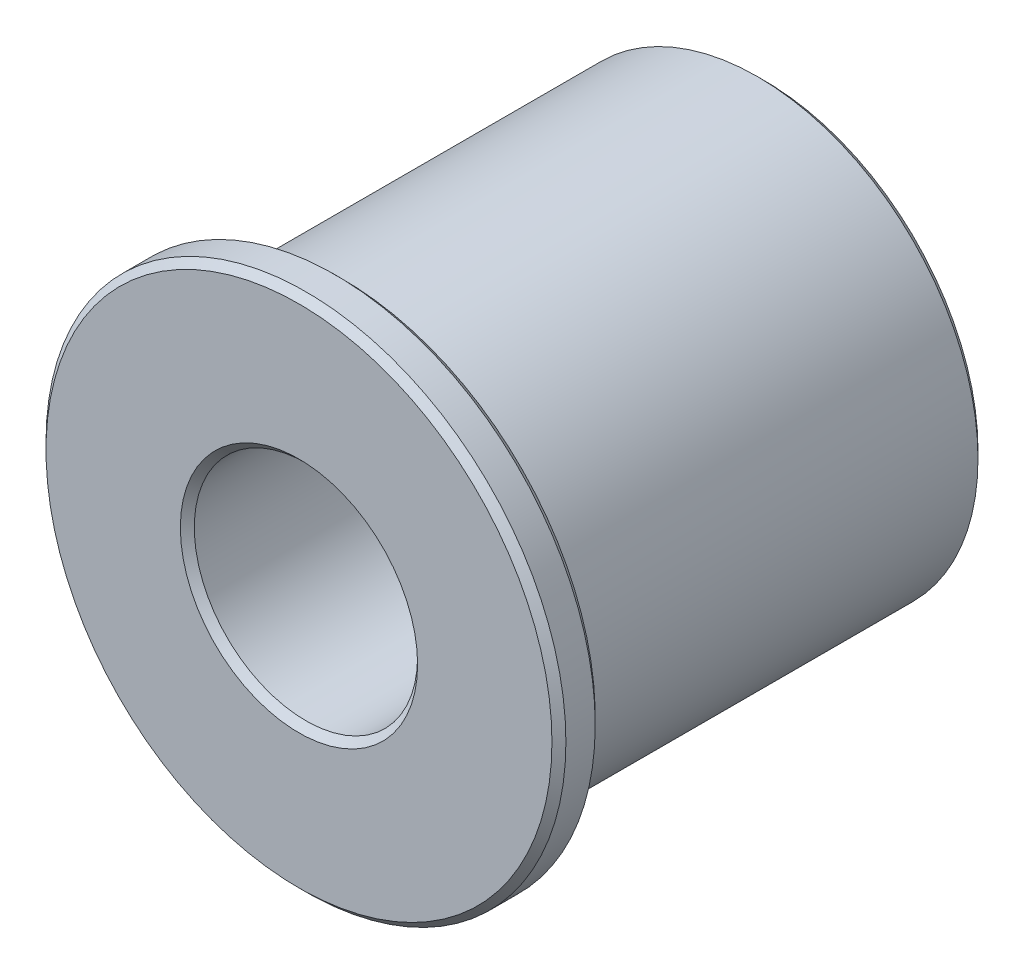
ISO-10303-21;
HEADER;
FILE_DESCRIPTION(('STEP AP214'),'2;1');
FILE_NAME('part.step','',(''),(''),'','','');
FILE_SCHEMA(('AUTOMOTIVE_DESIGN { 1 0 10303 214 1 1 1 1 }'));
ENDSEC;
DATA;
#1=APPLICATION_CONTEXT('core data for automotive mechanical design processes');
#2=APPLICATION_PROTOCOL_DEFINITION('international standard','automotive_design',2000,#1);
#3=PRODUCT_CONTEXT('',#1,'mechanical');
#4=PRODUCT('Part','Part','',(#3));
#5=PRODUCT_RELATED_PRODUCT_CATEGORY('part','',(#4));
#6=PRODUCT_DEFINITION_FORMATION('','',#4);
#7=PRODUCT_DEFINITION_CONTEXT('part definition',#1,'design');
#8=PRODUCT_DEFINITION('design','',#6,#7);
#9=PRODUCT_DEFINITION_SHAPE('','',#8);
#10=(LENGTH_UNIT() NAMED_UNIT(*) SI_UNIT(.MILLI.,.METRE.));
#11=(NAMED_UNIT(*) PLANE_ANGLE_UNIT() SI_UNIT($,.RADIAN.));
#12=(NAMED_UNIT(*) SI_UNIT($,.STERADIAN.) SOLID_ANGLE_UNIT());
#13=UNCERTAINTY_MEASURE_WITH_UNIT(LENGTH_MEASURE(1.E-05),#10,'distance_accuracy_value','');
#14=(GEOMETRIC_REPRESENTATION_CONTEXT(3) GLOBAL_UNCERTAINTY_ASSIGNED_CONTEXT((#13)) GLOBAL_UNIT_ASSIGNED_CONTEXT((#10,
#11,#12)) REPRESENTATION_CONTEXT('',''));
#15=CARTESIAN_POINT('',(0.,0.,0.));
#16=DIRECTION('',(0.,0.,1.));
#17=DIRECTION('',(1.,0.,0.));
#18=AXIS2_PLACEMENT_3D('',#15,#16,#17);
#19=CARTESIAN_POINT('',(0.,0.,0.));
#20=DIRECTION('',(0.,0.,1.));
#21=DIRECTION('',(1.,0.,0.));
#22=AXIS2_PLACEMENT_3D('',#19,#20,#21);
#23=CYLINDRICAL_SURFACE('',#22,2.286);
#24=CARTESIAN_POINT('',(0.,0.,10.346));
#25=DIRECTION('',(0.,0.,1.));
#26=DIRECTION('',(1.,0.,0.));
#27=AXIS2_PLACEMENT_3D('',#24,#25,#26);
#28=CIRCLE('',#27,2.286);
#29=CARTESIAN_POINT('',(2.286,0.,10.346));
#30=VERTEX_POINT('',#29);
#31=EDGE_CURVE('E71',#30,#30,#28,.T.);
#32=ORIENTED_EDGE('',*,*,#31,.T.);
#33=EDGE_LOOP('',(#32));
#34=FACE_BOUND('',#33,.T.);
#35=CARTESIAN_POINT('',(0.,0.,0.254));
#36=DIRECTION('',(0.,0.,-1.));
#37=DIRECTION('',(-1.,0.,0.));
#38=AXIS2_PLACEMENT_3D('',#35,#36,#37);
#39=CIRCLE('',#38,2.286);
#40=CARTESIAN_POINT('',(-2.286,0.,0.254));
#41=VERTEX_POINT('',#40);
#42=EDGE_CURVE('E74',#41,#41,#39,.T.);
#43=ORIENTED_EDGE('',*,*,#42,.T.);
#44=EDGE_LOOP('',(#43));
#45=FACE_BOUND('',#44,.T.);
#46=ADVANCED_FACE('F33',(#34,#45),#23,.F.);
#47=CARTESIAN_POINT('',(2.286,0.,10.6));
#48=DIRECTION('',(0.,0.,1.));
#49=DIRECTION('',(1.,0.,0.));
#50=AXIS2_PLACEMENT_3D('',#47,#48,#49);
#51=PLANE('',#50);
#52=CARTESIAN_POINT('',(0.,0.,10.6));
#53=DIRECTION('',(0.,0.,1.));
#54=DIRECTION('',(1.,0.,0.));
#55=AXIS2_PLACEMENT_3D('',#52,#53,#54);
#56=CIRCLE('',#55,2.54);
#57=CARTESIAN_POINT('',(2.54000000000001,0.,10.6));
#58=VERTEX_POINT('',#57);
#59=EDGE_CURVE('E68',#58,#58,#56,.F.);
#60=ORIENTED_EDGE('',*,*,#59,.T.);
#61=EDGE_LOOP('',(#60));
#62=FACE_BOUND('',#61,.T.);
#63=CARTESIAN_POINT('',(0.,0.,10.6));
#64=DIRECTION('',(0.,0.,1.));
#65=DIRECTION('',(1.,0.,0.));
#66=AXIS2_PLACEMENT_3D('',#63,#64,#65);
#67=CIRCLE('',#66,4.064);
#68=CARTESIAN_POINT('',(4.064,0.,10.6));
#69=VERTEX_POINT('',#68);
#70=EDGE_CURVE('E77',#69,#69,#67,.T.);
#71=ORIENTED_EDGE('',*,*,#70,.T.);
#72=EDGE_LOOP('',(#71));
#73=FACE_BOUND('',#72,.T.);
#74=ADVANCED_FACE('F101',(#62,#73),#51,.T.);
#75=CARTESIAN_POINT('',(0.,0.,0.));
#76=DIRECTION('',(0.,0.,1.));
#77=DIRECTION('',(1.,0.,0.));
#78=AXIS2_PLACEMENT_3D('',#75,#76,#77);
#79=CYLINDRICAL_SURFACE('',#78,4.064);
#80=CARTESIAN_POINT('',(0.,0.,16.6878));
#81=DIRECTION('',(0.,0.,1.));
#82=DIRECTION('',(1.,0.,0.));
#83=AXIS2_PLACEMENT_3D('',#80,#81,#82);
#84=CIRCLE('',#83,4.064);
#85=CARTESIAN_POINT('',(4.064,0.,16.6878));
#86=VERTEX_POINT('',#85);
#87=EDGE_CURVE('E56',#86,#86,#84,.T.);
#88=ORIENTED_EDGE('',*,*,#87,.T.);
#89=EDGE_LOOP('',(#88));
#90=FACE_BOUND('',#89,.T.);
#91=ORIENTED_EDGE('',*,*,#70,.F.);
#92=EDGE_LOOP('',(#91));
#93=FACE_BOUND('',#92,.T.);
#94=ADVANCED_FACE('F107',(#90,#93),#79,.F.);
#95=CARTESIAN_POINT('',(4.064,0.,16.9418));
#96=DIRECTION('',(0.,0.,1.));
#97=DIRECTION('',(1.,0.,0.));
#98=AXIS2_PLACEMENT_3D('',#95,#96,#97);
#99=PLANE('',#98);
#100=CARTESIAN_POINT('',(0.,0.,16.9418));
#101=DIRECTION('',(0.,0.,1.));
#102=DIRECTION('',(1.,0.,0.));
#103=AXIS2_PLACEMENT_3D('',#100,#101,#102);
#104=CIRCLE('',#103,4.31800000000001);
#105=CARTESIAN_POINT('',(4.31800000000001,0.,16.9418));
#106=VERTEX_POINT('',#105);
#107=EDGE_CURVE('E48',#106,#106,#104,.F.);
#108=ORIENTED_EDGE('',*,*,#107,.T.);
#109=EDGE_LOOP('',(#108));
#110=FACE_BOUND('',#109,.T.);
#111=CARTESIAN_POINT('',(0.,0.,16.9418));
#112=DIRECTION('',(0.,0.,1.));
#113=DIRECTION('',(1.,0.,0.));
#114=AXIS2_PLACEMENT_3D('',#111,#112,#113);
#115=CIRCLE('',#114,9.2075);
#116=CARTESIAN_POINT('',(9.2075,0.,16.9418));
#117=VERTEX_POINT('',#116);
#118=EDGE_CURVE('E53',#117,#117,#115,.T.);
#119=ORIENTED_EDGE('',*,*,#118,.T.);
#120=EDGE_LOOP('',(#119));
#121=FACE_BOUND('',#120,.T.);
#122=ADVANCED_FACE('F141',(#110,#121),#99,.T.);
#123=CARTESIAN_POINT('',(0.,0.,0.));
#124=DIRECTION('',(0.,0.,1.));
#125=DIRECTION('',(1.,0.,0.));
#126=AXIS2_PLACEMENT_3D('',#123,#124,#125);
#127=CYLINDRICAL_SURFACE('',#126,9.4615);
#128=CARTESIAN_POINT('',(0.,0.,15.621));
#129=DIRECTION('',(0.,0.,-1.));
#130=DIRECTION('',(-1.,0.,0.));
#131=AXIS2_PLACEMENT_3D('',#128,#129,#130);
#132=CIRCLE('',#131,9.4615);
#133=CARTESIAN_POINT('',(-9.4615,0.,15.621));
#134=VERTEX_POINT('',#133);
#135=EDGE_CURVE('E40',#134,#134,#132,.F.);
#136=ORIENTED_EDGE('',*,*,#135,.T.);
#137=EDGE_LOOP('',(#136));
#138=FACE_BOUND('',#137,.T.);
#139=CARTESIAN_POINT('',(0.,0.,16.6878));
#140=DIRECTION('',(0.,0.,1.));
#141=DIRECTION('',(1.,0.,0.));
#142=AXIS2_PLACEMENT_3D('',#139,#140,#141);
#143=CIRCLE('',#142,9.4615);
#144=CARTESIAN_POINT('',(9.4615,0.,16.6878));
#145=VERTEX_POINT('',#144);
#146=EDGE_CURVE('E44',#145,#145,#143,.F.);
#147=ORIENTED_EDGE('',*,*,#146,.T.);
#148=EDGE_LOOP('',(#147));
#149=FACE_BOUND('',#148,.T.);
#150=ADVANCED_FACE('F98',(#138,#149),#127,.T.);
#151=CARTESIAN_POINT('',(8.0264,0.,15.367));
#152=DIRECTION('',(0.,0.,-1.));
#153=DIRECTION('',(-1.,0.,0.));
#154=AXIS2_PLACEMENT_3D('',#151,#152,#153);
#155=PLANE('',#154);
#156=CARTESIAN_POINT('',(0.,0.,15.367));
#157=DIRECTION('',(0.,0.,-1.));
#158=DIRECTION('',(-1.,0.,0.));
#159=AXIS2_PLACEMENT_3D('',#156,#157,#158);
#160=CIRCLE('',#159,9.2075);
#161=CARTESIAN_POINT('',(-9.2075,0.,15.367));
#162=VERTEX_POINT('',#161);
#163=EDGE_CURVE('E10',#162,#162,#160,.T.);
#164=ORIENTED_EDGE('',*,*,#163,.T.);
#165=EDGE_LOOP('',(#164));
#166=FACE_BOUND('',#165,.T.);
#167=CARTESIAN_POINT('',(0.,0.,15.367));
#168=DIRECTION('',(0.,0.,1.));
#169=DIRECTION('',(1.,0.,0.));
#170=AXIS2_PLACEMENT_3D('',#167,#168,#169);
#171=CIRCLE('',#170,8.0264);
#172=CARTESIAN_POINT('',(8.0264,0.,15.367));
#173=VERTEX_POINT('',#172);
#174=EDGE_CURVE('E80',#173,#173,#171,.T.);
#175=ORIENTED_EDGE('',*,*,#174,.T.);
#176=EDGE_LOOP('',(#175));
#177=FACE_BOUND('',#176,.T.);
#178=ADVANCED_FACE('F84',(#166,#177),#155,.T.);
#179=CARTESIAN_POINT('',(0.,0.,0.));
#180=DIRECTION('',(0.,0.,1.));
#181=DIRECTION('',(1.,0.,0.));
#182=AXIS2_PLACEMENT_3D('',#179,#180,#181);
#183=CYLINDRICAL_SURFACE('',#182,8.0264);
#184=CARTESIAN_POINT('',(0.,0.,0.254000000000003));
#185=DIRECTION('',(0.,0.,-1.));
#186=DIRECTION('',(-1.,0.,0.));
#187=AXIS2_PLACEMENT_3D('',#184,#185,#186);
#188=CIRCLE('',#187,8.0264);
#189=CARTESIAN_POINT('',(-8.0264,0.,0.254000000000004));
#190=VERTEX_POINT('',#189);
#191=EDGE_CURVE('E59',#190,#190,#188,.F.);
#192=ORIENTED_EDGE('',*,*,#191,.T.);
#193=EDGE_LOOP('',(#192));
#194=FACE_BOUND('',#193,.T.);
#195=ORIENTED_EDGE('',*,*,#174,.F.);
#196=EDGE_LOOP('',(#195));
#197=FACE_BOUND('',#196,.T.);
#198=ADVANCED_FACE('F86',(#194,#197),#183,.T.);
#199=CARTESIAN_POINT('',(8.0264,0.,0.));
#200=DIRECTION('',(0.,0.,-1.));
#201=DIRECTION('',(-1.,0.,0.));
#202=AXIS2_PLACEMENT_3D('',#199,#200,#201);
#203=PLANE('',#202);
#204=CARTESIAN_POINT('',(0.,0.,0.));
#205=DIRECTION('',(0.,0.,-1.));
#206=DIRECTION('',(-1.,0.,0.));
#207=AXIS2_PLACEMENT_3D('',#204,#205,#206);
#208=CIRCLE('',#207,2.54);
#209=CARTESIAN_POINT('',(-2.54,0.,0.));
#210=VERTEX_POINT('',#209);
#211=EDGE_CURVE('E62',#210,#210,#208,.F.);
#212=ORIENTED_EDGE('',*,*,#211,.T.);
#213=EDGE_LOOP('',(#212));
#214=FACE_BOUND('',#213,.T.);
#215=CARTESIAN_POINT('',(0.,0.,0.));
#216=DIRECTION('',(0.,0.,-1.));
#217=DIRECTION('',(-1.,0.,0.));
#218=AXIS2_PLACEMENT_3D('',#215,#216,#217);
#219=CIRCLE('',#218,7.77239999999999);
#220=CARTESIAN_POINT('',(-7.77239999999999,0.,0.));
#221=VERTEX_POINT('',#220);
#222=EDGE_CURVE('E65',#221,#221,#219,.T.);
#223=ORIENTED_EDGE('',*,*,#222,.T.);
#224=EDGE_LOOP('',(#223));
#225=FACE_BOUND('',#224,.T.);
#226=ADVANCED_FACE('F88',(#214,#225),#203,.T.);
#227=CARTESIAN_POINT('',(0.,0.,10.346));
#228=DIRECTION('',(0.,0.,1.));
#229=DIRECTION('',(1.,0.,0.));
#230=AXIS2_PLACEMENT_3D('',#227,#228,#229);
#231=CONICAL_SURFACE('',#230,2.286,0.785398163397458);
#232=ORIENTED_EDGE('',*,*,#59,.F.);
#233=EDGE_LOOP('',(#232));
#234=FACE_BOUND('',#233,.T.);
#235=ORIENTED_EDGE('',*,*,#31,.F.);
#236=EDGE_LOOP('',(#235));
#237=FACE_BOUND('',#236,.T.);
#238=ADVANCED_FACE('F95',(#234,#237),#231,.F.);
#239=CARTESIAN_POINT('',(0.,0.,0.));
#240=DIRECTION('',(0.,0.,-1.));
#241=DIRECTION('',(-1.,0.,0.));
#242=AXIS2_PLACEMENT_3D('',#239,#240,#241);
#243=CONICAL_SURFACE('',#242,2.54,0.785398163397443);
#244=ORIENTED_EDGE('',*,*,#42,.F.);
#245=EDGE_LOOP('',(#244));
#246=FACE_BOUND('',#245,.T.);
#247=ORIENTED_EDGE('',*,*,#211,.F.);
#248=EDGE_LOOP('',(#247));
#249=FACE_BOUND('',#248,.T.);
#250=ADVANCED_FACE('F115',(#246,#249),#243,.F.);
#251=CARTESIAN_POINT('',(0.,0.,0.254000000000003));
#252=DIRECTION('',(0.,0.,1.));
#253=DIRECTION('',(1.,0.,0.));
#254=AXIS2_PLACEMENT_3D('',#251,#252,#253);
#255=CONICAL_SURFACE('',#254,8.0264,0.785398163397455);
#256=ORIENTED_EDGE('',*,*,#222,.F.);
#257=EDGE_LOOP('',(#256));
#258=FACE_BOUND('',#257,.T.);
#259=ORIENTED_EDGE('',*,*,#191,.F.);
#260=EDGE_LOOP('',(#259));
#261=FACE_BOUND('',#260,.T.);
#262=ADVANCED_FACE('F119',(#258,#261),#255,.T.);
#263=CARTESIAN_POINT('',(0.,0.,16.6878));
#264=DIRECTION('',(0.,0.,1.));
#265=DIRECTION('',(1.,0.,0.));
#266=AXIS2_PLACEMENT_3D('',#263,#264,#265);
#267=CONICAL_SURFACE('',#266,4.064,0.78539816339745);
#268=ORIENTED_EDGE('',*,*,#107,.F.);
#269=EDGE_LOOP('',(#268));
#270=FACE_BOUND('',#269,.T.);
#271=ORIENTED_EDGE('',*,*,#87,.F.);
#272=EDGE_LOOP('',(#271));
#273=FACE_BOUND('',#272,.T.);
#274=ADVANCED_FACE('F123',(#270,#273),#267,.F.);
#275=CARTESIAN_POINT('',(0.,0.,15.621));
#276=DIRECTION('',(0.,0.,1.));
#277=DIRECTION('',(1.,0.,0.));
#278=AXIS2_PLACEMENT_3D('',#275,#276,#277);
#279=CONICAL_SURFACE('',#278,9.4615,0.785398163397442);
#280=ORIENTED_EDGE('',*,*,#163,.F.);
#281=EDGE_LOOP('',(#280));
#282=FACE_BOUND('',#281,.T.);
#283=ORIENTED_EDGE('',*,*,#135,.F.);
#284=EDGE_LOOP('',(#283));
#285=FACE_BOUND('',#284,.T.);
#286=ADVANCED_FACE('F126',(#282,#285),#279,.T.);
#287=CARTESIAN_POINT('',(0.,0.,16.9418));
#288=DIRECTION('',(0.,0.,-1.));
#289=DIRECTION('',(-1.,0.,0.));
#290=AXIS2_PLACEMENT_3D('',#287,#288,#289);
#291=CONICAL_SURFACE('',#290,9.2075,0.785398163397452);
#292=ORIENTED_EDGE('',*,*,#146,.F.);
#293=EDGE_LOOP('',(#292));
#294=FACE_BOUND('',#293,.T.);
#295=ORIENTED_EDGE('',*,*,#118,.F.);
#296=EDGE_LOOP('',(#295));
#297=FACE_BOUND('',#296,.T.);
#298=ADVANCED_FACE('F35',(#294,#297),#291,.T.);
#299=CLOSED_SHELL('',(#46,#74,#94,#122,#150,#178,#198,#226,#238,#250,#262,#274,#286,#298));
#300=MANIFOLD_SOLID_BREP('B2',#299);
#301=ADVANCED_BREP_SHAPE_REPRESENTATION('',(#18,#300),#14);
#302=SHAPE_DEFINITION_REPRESENTATION(#9,#301);
ENDSEC;
END-ISO-10303-21;
